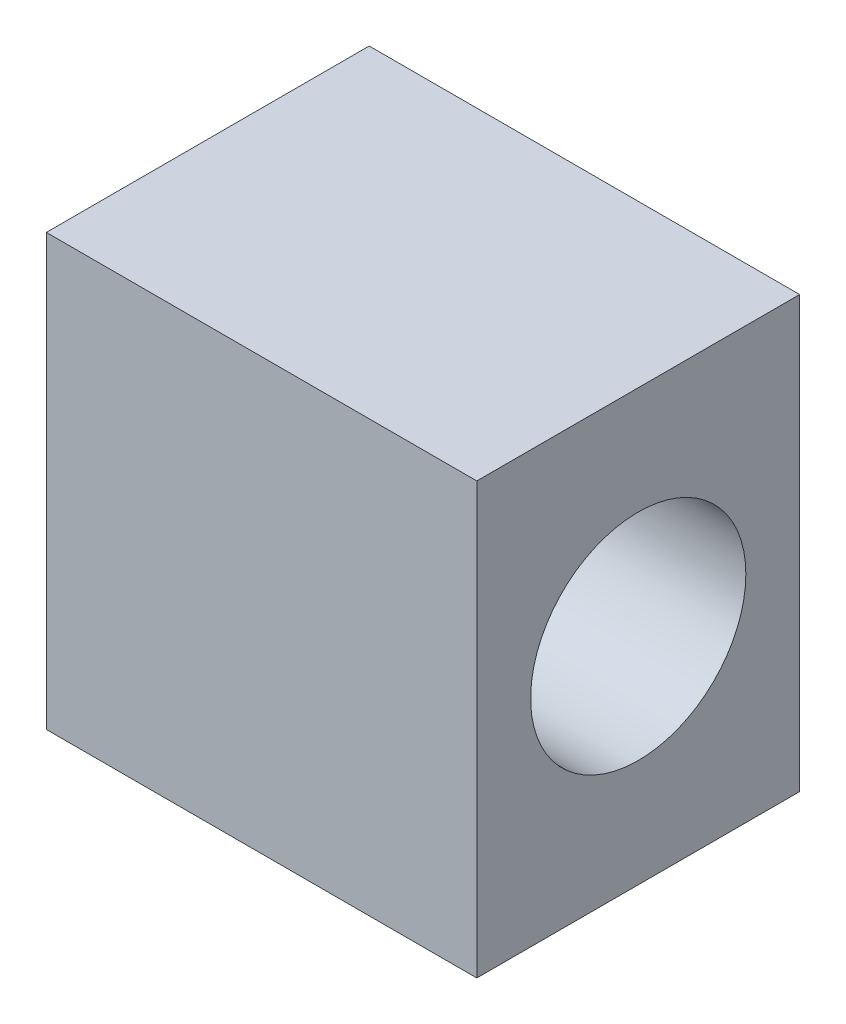
ISO-10303-21;
HEADER;
FILE_DESCRIPTION(('STEP AP214'),'2;1');
FILE_NAME('part.step','',(''),(''),'','','');
FILE_SCHEMA(('AUTOMOTIVE_DESIGN { 1 0 10303 214 1 1 1 1 }'));
ENDSEC;
DATA;
#1=APPLICATION_CONTEXT('core data for automotive mechanical design processes');
#2=APPLICATION_PROTOCOL_DEFINITION('international standard','automotive_design',2000,#1);
#3=PRODUCT_CONTEXT('',#1,'mechanical');
#4=PRODUCT('Part','Part','',(#3));
#5=PRODUCT_RELATED_PRODUCT_CATEGORY('part','',(#4));
#6=PRODUCT_DEFINITION_FORMATION('','',#4);
#7=PRODUCT_DEFINITION_CONTEXT('part definition',#1,'design');
#8=PRODUCT_DEFINITION('design','',#6,#7);
#9=PRODUCT_DEFINITION_SHAPE('','',#8);
#10=(LENGTH_UNIT() NAMED_UNIT(*) SI_UNIT(.MILLI.,.METRE.));
#11=(NAMED_UNIT(*) PLANE_ANGLE_UNIT() SI_UNIT($,.RADIAN.));
#12=(NAMED_UNIT(*) SI_UNIT($,.STERADIAN.) SOLID_ANGLE_UNIT());
#13=UNCERTAINTY_MEASURE_WITH_UNIT(LENGTH_MEASURE(1.E-05),#10,'distance_accuracy_value','');
#14=(GEOMETRIC_REPRESENTATION_CONTEXT(3) GLOBAL_UNCERTAINTY_ASSIGNED_CONTEXT((#13)) GLOBAL_UNIT_ASSIGNED_CONTEXT((#10,
#11,#12)) REPRESENTATION_CONTEXT('',''));
#15=CARTESIAN_POINT('',(0.,0.,0.));
#16=DIRECTION('',(0.,0.,1.));
#17=DIRECTION('',(1.,0.,0.));
#18=AXIS2_PLACEMENT_3D('',#15,#16,#17);
#19=CARTESIAN_POINT('',(10.,20.,7.5));
#20=DIRECTION('',(-1.,0.,0.));
#21=DIRECTION('',(0.,0.,1.));
#22=AXIS2_PLACEMENT_3D('',#19,#20,#21);
#23=PLANE('',#22);
#24=CARTESIAN_POINT('',(10.,10.,0.));
#25=DIRECTION('',(1.,0.,0.));
#26=DIRECTION('',(0.,0.,-1.));
#27=AXIS2_PLACEMENT_3D('',#24,#25,#26);
#28=CIRCLE('',#27,5.);
#29=CARTESIAN_POINT('',(10.,10.,-5.));
#30=VERTEX_POINT('',#29);
#31=EDGE_CURVE('E114',#30,#30,#28,.T.);
#32=ORIENTED_EDGE('',*,*,#31,.F.);
#33=EDGE_LOOP('',(#32));
#34=FACE_BOUND('',#33,.T.);
#35=DIRECTION('',(0.,0.,-1.));
#36=VECTOR('',#35,1.);
#37=CARTESIAN_POINT('',(10.,0.,7.5));
#38=LINE('',#37,#36);
#39=CARTESIAN_POINT('',(10.,0.,7.5));
#40=VERTEX_POINT('',#39);
#41=CARTESIAN_POINT('',(10.,0.,-7.5));
#42=VERTEX_POINT('',#41);
#43=EDGE_CURVE('E100',#40,#42,#38,.T.);
#44=ORIENTED_EDGE('',*,*,#43,.T.);
#45=DIRECTION('',(0.,-1.,0.));
#46=VECTOR('',#45,1.);
#47=CARTESIAN_POINT('',(10.,20.,-7.5));
#48=LINE('',#47,#46);
#49=CARTESIAN_POINT('',(10.,20.,-7.5));
#50=VERTEX_POINT('',#49);
#51=EDGE_CURVE('E11',#50,#42,#48,.T.);
#52=ORIENTED_EDGE('',*,*,#51,.F.);
#53=DIRECTION('',(0.,0.,-1.));
#54=VECTOR('',#53,1.);
#55=CARTESIAN_POINT('',(10.,20.,7.5));
#56=LINE('',#55,#54);
#57=CARTESIAN_POINT('',(10.,20.,7.5));
#58=VERTEX_POINT('',#57);
#59=EDGE_CURVE('E88',#58,#50,#56,.T.);
#60=ORIENTED_EDGE('',*,*,#59,.F.);
#61=DIRECTION('',(0.,-1.,0.));
#62=VECTOR('',#61,1.);
#63=CARTESIAN_POINT('',(10.,20.,7.5));
#64=LINE('',#63,#62);
#65=EDGE_CURVE('E96',#58,#40,#64,.T.);
#66=ORIENTED_EDGE('',*,*,#65,.T.);
#67=EDGE_LOOP('',(#44,#52,#60,#66));
#68=FACE_BOUND('',#67,.T.);
#69=ADVANCED_FACE('F37',(#34,#68),#23,.F.);
#70=CARTESIAN_POINT('',(-10.,20.,-7.5));
#71=DIRECTION('',(0.,0.,1.));
#72=DIRECTION('',(1.,0.,0.));
#73=AXIS2_PLACEMENT_3D('',#70,#71,#72);
#74=PLANE('',#73);
#75=DIRECTION('',(-1.,0.,0.));
#76=VECTOR('',#75,1.);
#77=CARTESIAN_POINT('',(-10.,0.,-7.5));
#78=LINE('',#77,#76);
#79=CARTESIAN_POINT('',(-10.,0.,-7.5));
#80=VERTEX_POINT('',#79);
#81=EDGE_CURVE('E92',#42,#80,#78,.T.);
#82=ORIENTED_EDGE('',*,*,#81,.T.);
#83=DIRECTION('',(0.,-1.,0.));
#84=VECTOR('',#83,1.);
#85=CARTESIAN_POINT('',(-10.,20.,-7.5));
#86=LINE('',#85,#84);
#87=CARTESIAN_POINT('',(-10.,20.,-7.5));
#88=VERTEX_POINT('',#87);
#89=EDGE_CURVE('E45',#88,#80,#86,.T.);
#90=ORIENTED_EDGE('',*,*,#89,.F.);
#91=DIRECTION('',(-1.,0.,0.));
#92=VECTOR('',#91,1.);
#93=CARTESIAN_POINT('',(-10.,20.,-7.5));
#94=LINE('',#93,#92);
#95=EDGE_CURVE('E83',#50,#88,#94,.T.);
#96=ORIENTED_EDGE('',*,*,#95,.F.);
#97=ORIENTED_EDGE('',*,*,#51,.T.);
#98=EDGE_LOOP('',(#82,#90,#96,#97));
#99=FACE_BOUND('',#98,.T.);
#100=ADVANCED_FACE('F91',(#99),#74,.F.);
#101=CARTESIAN_POINT('',(-10.,20.,-7.5));
#102=DIRECTION('',(1.,0.,0.));
#103=DIRECTION('',(0.,0.,-1.));
#104=AXIS2_PLACEMENT_3D('',#101,#102,#103);
#105=PLANE('',#104);
#106=DIRECTION('',(0.,0.,1.));
#107=VECTOR('',#106,1.);
#108=CARTESIAN_POINT('',(-10.,0.,-7.5));
#109=LINE('',#108,#107);
#110=CARTESIAN_POINT('',(-10.,0.,7.5));
#111=VERTEX_POINT('',#110);
#112=EDGE_CURVE('E70',#80,#111,#109,.T.);
#113=ORIENTED_EDGE('',*,*,#112,.T.);
#114=DIRECTION('',(0.,-1.,0.));
#115=VECTOR('',#114,1.);
#116=CARTESIAN_POINT('',(-10.,20.,7.5));
#117=LINE('',#116,#115);
#118=CARTESIAN_POINT('',(-10.,20.,7.5));
#119=VERTEX_POINT('',#118);
#120=EDGE_CURVE('E93',#119,#111,#117,.T.);
#121=ORIENTED_EDGE('',*,*,#120,.F.);
#122=DIRECTION('',(0.,0.,1.));
#123=VECTOR('',#122,1.);
#124=CARTESIAN_POINT('',(-10.,20.,-7.5));
#125=LINE('',#124,#123);
#126=EDGE_CURVE('E86',#88,#119,#125,.T.);
#127=ORIENTED_EDGE('',*,*,#126,.F.);
#128=ORIENTED_EDGE('',*,*,#89,.T.);
#129=EDGE_LOOP('',(#113,#121,#127,#128));
#130=FACE_BOUND('',#129,.T.);
#131=ADVANCED_FACE('F94',(#130),#105,.F.);
#132=CARTESIAN_POINT('',(-10.,20.,7.5));
#133=DIRECTION('',(0.,0.,-1.));
#134=DIRECTION('',(-1.,0.,0.));
#135=AXIS2_PLACEMENT_3D('',#132,#133,#134);
#136=PLANE('',#135);
#137=DIRECTION('',(1.,0.,0.));
#138=VECTOR('',#137,1.);
#139=CARTESIAN_POINT('',(-10.,0.,7.5));
#140=LINE('',#139,#138);
#141=EDGE_CURVE('E76',#111,#40,#140,.T.);
#142=ORIENTED_EDGE('',*,*,#141,.T.);
#143=ORIENTED_EDGE('',*,*,#65,.F.);
#144=DIRECTION('',(1.,0.,0.));
#145=VECTOR('',#144,1.);
#146=CARTESIAN_POINT('',(-10.,20.,7.5));
#147=LINE('',#146,#145);
#148=EDGE_CURVE('E53',#119,#58,#147,.T.);
#149=ORIENTED_EDGE('',*,*,#148,.F.);
#150=ORIENTED_EDGE('',*,*,#120,.T.);
#151=EDGE_LOOP('',(#142,#143,#149,#150));
#152=FACE_BOUND('',#151,.T.);
#153=ADVANCED_FACE('F108',(#152),#136,.F.);
#154=CARTESIAN_POINT('',(0.,20.,0.));
#155=DIRECTION('',(0.,-1.,0.));
#156=DIRECTION('',(0.,0.,-1.));
#157=AXIS2_PLACEMENT_3D('',#154,#155,#156);
#158=PLANE('',#157);
#159=ORIENTED_EDGE('',*,*,#59,.T.);
#160=ORIENTED_EDGE('',*,*,#95,.T.);
#161=ORIENTED_EDGE('',*,*,#126,.T.);
#162=ORIENTED_EDGE('',*,*,#148,.T.);
#163=EDGE_LOOP('',(#159,#160,#161,#162));
#164=FACE_BOUND('',#163,.T.);
#165=ADVANCED_FACE('F84',(#164),#158,.F.);
#166=CARTESIAN_POINT('',(0.,0.,0.));
#167=DIRECTION('',(0.,-1.,0.));
#168=DIRECTION('',(0.,0.,-1.));
#169=AXIS2_PLACEMENT_3D('',#166,#167,#168);
#170=PLANE('',#169);
#171=ORIENTED_EDGE('',*,*,#43,.F.);
#172=ORIENTED_EDGE('',*,*,#141,.F.);
#173=ORIENTED_EDGE('',*,*,#112,.F.);
#174=ORIENTED_EDGE('',*,*,#81,.F.);
#175=EDGE_LOOP('',(#171,#172,#173,#174));
#176=FACE_BOUND('',#175,.T.);
#177=ADVANCED_FACE('F111',(#176),#170,.T.);
#178=CARTESIAN_POINT('',(0.,10.,0.));
#179=DIRECTION('',(1.,0.,0.));
#180=DIRECTION('',(0.,0.,-1.));
#181=AXIS2_PLACEMENT_3D('',#178,#179,#180);
#182=CYLINDRICAL_SURFACE('',#181,5.);
#183=CARTESIAN_POINT('',(0.,10.,0.));
#184=DIRECTION('',(1.,0.,0.));
#185=DIRECTION('',(0.,0.,-1.));
#186=AXIS2_PLACEMENT_3D('',#183,#184,#185);
#187=CIRCLE('',#186,5.);
#188=CARTESIAN_POINT('',(0.,10.,-5.));
#189=VERTEX_POINT('',#188);
#190=EDGE_CURVE('E103',#189,#189,#187,.T.);
#191=ORIENTED_EDGE('',*,*,#190,.F.);
#192=EDGE_LOOP('',(#191));
#193=FACE_BOUND('',#192,.T.);
#194=ORIENTED_EDGE('',*,*,#31,.T.);
#195=EDGE_LOOP('',(#194));
#196=FACE_BOUND('',#195,.T.);
#197=ADVANCED_FACE('F122',(#193,#196),#182,.F.);
#198=CARTESIAN_POINT('',(0.,10.,0.));
#199=DIRECTION('',(1.,0.,0.));
#200=DIRECTION('',(0.,0.,-1.));
#201=AXIS2_PLACEMENT_3D('',#198,#199,#200);
#202=PLANE('',#201);
#203=ORIENTED_EDGE('',*,*,#190,.T.);
#204=EDGE_LOOP('',(#203));
#205=FACE_BOUND('',#204,.T.);
#206=ADVANCED_FACE('F120',(#205),#202,.T.);
#207=CLOSED_SHELL('',(#69,#100,#131,#153,#165,#177,#197,#206));
#208=MANIFOLD_SOLID_BREP('B2',#207);
#209=ADVANCED_BREP_SHAPE_REPRESENTATION('',(#18,#208),#14);
#210=SHAPE_DEFINITION_REPRESENTATION(#9,#209);
ENDSEC;
END-ISO-10303-21;
